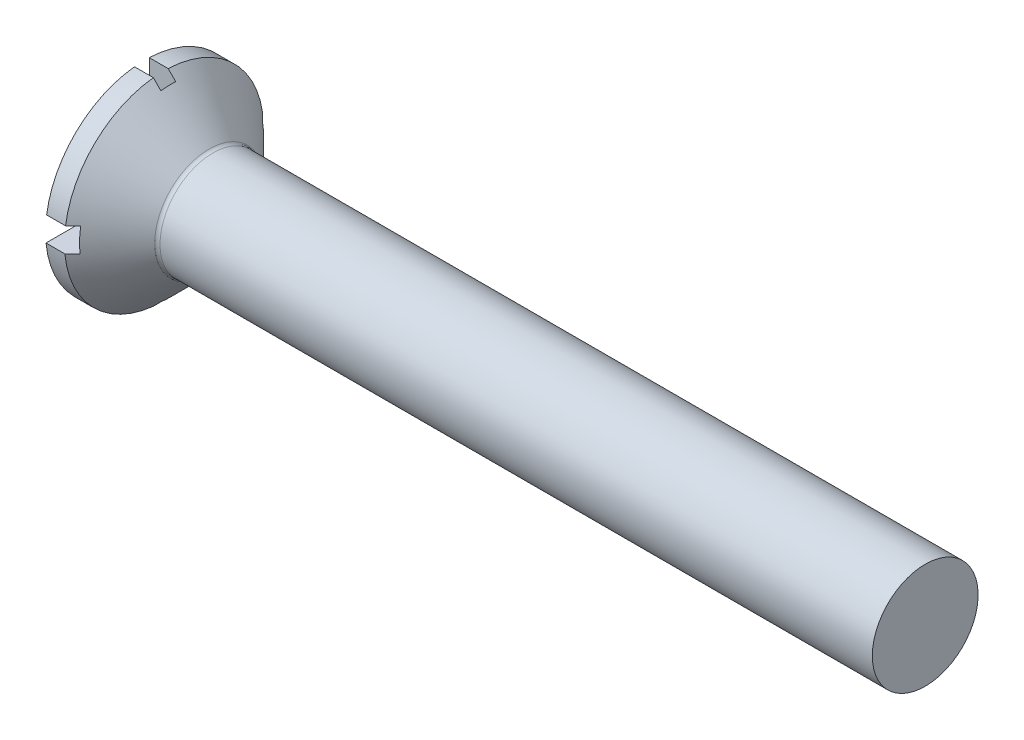
ISO-10303-21;
HEADER;
FILE_DESCRIPTION(('STEP AP214'),'2;1');
FILE_NAME('part.step','',(''),(''),'','','');
FILE_SCHEMA(('AUTOMOTIVE_DESIGN { 1 0 10303 214 1 1 1 1 }'));
ENDSEC;
DATA;
#1=APPLICATION_CONTEXT('core data for automotive mechanical design processes');
#2=APPLICATION_PROTOCOL_DEFINITION('international standard','automotive_design',2000,#1);
#3=PRODUCT_CONTEXT('',#1,'mechanical');
#4=PRODUCT('Part','Part','',(#3));
#5=PRODUCT_RELATED_PRODUCT_CATEGORY('part','',(#4));
#6=PRODUCT_DEFINITION_FORMATION('','',#4);
#7=PRODUCT_DEFINITION_CONTEXT('part definition',#1,'design');
#8=PRODUCT_DEFINITION('design','',#6,#7);
#9=PRODUCT_DEFINITION_SHAPE('','',#8);
#10=(LENGTH_UNIT() NAMED_UNIT(*) SI_UNIT(.MILLI.,.METRE.));
#11=(NAMED_UNIT(*) PLANE_ANGLE_UNIT() SI_UNIT($,.RADIAN.));
#12=(NAMED_UNIT(*) SI_UNIT($,.STERADIAN.) SOLID_ANGLE_UNIT());
#13=UNCERTAINTY_MEASURE_WITH_UNIT(LENGTH_MEASURE(1.E-05),#10,'distance_accuracy_value','');
#14=(GEOMETRIC_REPRESENTATION_CONTEXT(3) GLOBAL_UNCERTAINTY_ASSIGNED_CONTEXT((#13)) GLOBAL_UNIT_ASSIGNED_CONTEXT((#10,
#11,#12)) REPRESENTATION_CONTEXT('',''));
#15=CARTESIAN_POINT('',(0.,0.,0.));
#16=DIRECTION('',(0.,0.,1.));
#17=DIRECTION('',(1.,0.,0.));
#18=AXIS2_PLACEMENT_3D('',#15,#16,#17);
#19=CARTESIAN_POINT('',(1.,0.,0.));
#20=DIRECTION('',(-1.,0.,0.));
#21=DIRECTION('',(0.,0.,1.));
#22=AXIS2_PLACEMENT_3D('',#19,#20,#21);
#23=PLANE('',#22);
#24=DIRECTION('',(0.,1.,0.));
#25=VECTOR('',#24,1.);
#26=CARTESIAN_POINT('',(1.,-0.355709243839864,-0.156923110621762));
#27=LINE('',#26,#25);
#28=CARTESIAN_POINT('',(1.,-0.355709243839864,-0.156923110621762));
#29=VERTEX_POINT('',#28);
#30=CARTESIAN_POINT('',(1.0000000000166,-3.47646014463617,-0.156923110621762));
#31=VERTEX_POINT('',#30);
#32=EDGE_CURVE('E329',#29,#31,#27,.F.);
#33=ORIENTED_EDGE('',*,*,#32,.T.);
#34=CARTESIAN_POINT('',(1.0000000000332,0.,0.));
#35=DIRECTION('',(-1.,0.,0.));
#36=DIRECTION('',(0.,0.,1.));
#37=AXIS2_PLACEMENT_3D('',#34,#35,#36);
#38=CIRCLE('',#37,3.47999999996773);
#39=CARTESIAN_POINT('',(1.00000000002008,-3.456568160324,0.403158223159427));
#40=VERTEX_POINT('',#39);
#41=EDGE_CURVE('E229',#31,#40,#38,.T.);
#42=ORIENTED_EDGE('',*,*,#41,.T.);
#43=DIRECTION('',(0.,-1.,0.));
#44=VECTOR('',#43,1.);
#45=CARTESIAN_POINT('',(1.,-4.05674824255773,0.403158223159427));
#46=LINE('',#45,#44);
#47=CARTESIAN_POINT('',(1.,-0.355709243839864,0.403158223159425));
#48=VERTEX_POINT('',#47);
#49=EDGE_CURVE('E138',#40,#48,#46,.F.);
#50=ORIENTED_EDGE('',*,*,#49,.T.);
#51=DIRECTION('',(0.,0.,-1.));
#52=VECTOR('',#51,1.);
#53=CARTESIAN_POINT('',(1.,-0.355709243839864,0.403158223159425));
#54=LINE('',#53,#52);
#55=CARTESIAN_POINT('',(1.0000000000166,-0.355709243839867,3.46177280215467));
#56=VERTEX_POINT('',#55);
#57=EDGE_CURVE('E154',#48,#56,#54,.F.);
#58=ORIENTED_EDGE('',*,*,#57,.T.);
#59=CARTESIAN_POINT('',(1.0000000000332,0.,0.));
#60=DIRECTION('',(-1.,0.,0.));
#61=DIRECTION('',(0.,0.,1.));
#62=AXIS2_PLACEMENT_3D('',#59,#60,#61);
#63=CIRCLE('',#62,3.47999999996773);
#64=CARTESIAN_POINT('',(1.00000000002006,0.550618510763713,3.43616345005169));
#65=VERTEX_POINT('',#64);
#66=EDGE_CURVE('E19',#56,#65,#63,.T.);
#67=ORIENTED_EDGE('',*,*,#66,.T.);
#68=DIRECTION('',(0.,0.,1.));
#69=VECTOR('',#68,1.);
#70=CARTESIAN_POINT('',(1.,0.550618510763713,4.40763775047384));
#71=LINE('',#70,#69);
#72=CARTESIAN_POINT('',(1.,0.550618510763712,0.403158223159425));
#73=VERTEX_POINT('',#72);
#74=EDGE_CURVE('E118',#65,#73,#71,.F.);
#75=ORIENTED_EDGE('',*,*,#74,.T.);
#76=DIRECTION('',(0.,-1.,0.));
#77=VECTOR('',#76,1.);
#78=CARTESIAN_POINT('',(1.,0.550618510763713,0.403158223159425));
#79=LINE('',#78,#77);
#80=CARTESIAN_POINT('',(1.0000000000166,3.4565681603275,0.403158223159424));
#81=VERTEX_POINT('',#80);
#82=EDGE_CURVE('E338',#73,#81,#79,.F.);
#83=ORIENTED_EDGE('',*,*,#82,.T.);
#84=CARTESIAN_POINT('',(1.0000000000332,0.,0.));
#85=DIRECTION('',(-1.,0.,0.));
#86=DIRECTION('',(0.,0.,1.));
#87=AXIS2_PLACEMENT_3D('',#84,#85,#86);
#88=CIRCLE('',#87,3.47999999996773);
#89=CARTESIAN_POINT('',(1.0000000000201,3.47646014463266,-0.156923110621762));
#90=VERTEX_POINT('',#89);
#91=EDGE_CURVE('E153',#81,#90,#88,.T.);
#92=ORIENTED_EDGE('',*,*,#91,.T.);
#93=DIRECTION('',(0.,1.,0.));
#94=VECTOR('',#93,1.);
#95=CARTESIAN_POINT('',(1.,4.34325175744227,-0.156923110621762));
#96=LINE('',#95,#94);
#97=CARTESIAN_POINT('',(1.,0.550618510763712,-0.156923110621762));
#98=VERTEX_POINT('',#97);
#99=EDGE_CURVE('E340',#90,#98,#96,.F.);
#100=ORIENTED_EDGE('',*,*,#99,.T.);
#101=DIRECTION('',(0.,0.,1.));
#102=VECTOR('',#101,1.);
#103=CARTESIAN_POINT('',(1.,0.550618510763713,-0.156923110621761));
#104=LINE('',#103,#102);
#105=CARTESIAN_POINT('',(1.0000000000166,0.550618510763713,-3.4361634500552));
#106=VERTEX_POINT('',#105);
#107=EDGE_CURVE('E228',#98,#106,#104,.F.);
#108=ORIENTED_EDGE('',*,*,#107,.T.);
#109=CARTESIAN_POINT('',(1.0000000000332,0.,0.));
#110=DIRECTION('',(-1.,0.,0.));
#111=DIRECTION('',(0.,0.,1.));
#112=AXIS2_PLACEMENT_3D('',#109,#110,#111);
#113=CIRCLE('',#112,3.47999999996773);
#114=CARTESIAN_POINT('',(1.00000000002009,-0.355709243839861,-3.46177280215116));
#115=VERTEX_POINT('',#114);
#116=EDGE_CURVE('E401',#106,#115,#113,.T.);
#117=ORIENTED_EDGE('',*,*,#116,.T.);
#118=DIRECTION('',(0.,0.,-1.));
#119=VECTOR('',#118,1.);
#120=CARTESIAN_POINT('',(1.,-0.355709243839861,-4.09236224952616));
#121=LINE('',#120,#119);
#122=EDGE_CURVE('E147',#115,#29,#121,.F.);
#123=ORIENTED_EDGE('',*,*,#122,.T.);
#124=EDGE_LOOP('',(#33,#42,#50,#58,#67,#75,#83,#92,#100,#108,#117,#123));
#125=FACE_BOUND('',#124,.T.);
#126=ADVANCED_FACE('F16',(#125),#23,.T.);
#127=CARTESIAN_POINT('',(1.,0.550618510763713,-0.156923110621761));
#128=DIRECTION('',(0.,1.,0.));
#129=DIRECTION('',(0.,0.,1.));
#130=AXIS2_PLACEMENT_3D('',#127,#128,#129);
#131=PLANE('',#130);
#132=CARTESIAN_POINT('',(1.00000000000693,0.550618510763713,-3.43616345006499));
#133=CARTESIAN_POINT('',(0.952522390497496,0.550618510763713,-3.48424489385891));
#134=CARTESIAN_POINT('',(0.905033585692067,0.550618510763713,-3.53231527264755));
#135=CARTESIAN_POINT('',(0.810033585692013,0.550618510763713,-3.62843390000909));
#136=CARTESIAN_POINT('',(0.762522390497485,0.550618510763712,-3.67648214858208));
#137=CARTESIAN_POINT('',(0.715000000007059,0.550618510763712,-3.72451933214988));
#138=B_SPLINE_CURVE_WITH_KNOTS('',3,(#132,#133,#134,#135,#136,#137),.UNSPECIFIED.,.F.,.F.,(4,2,
4),(0.,0.202715394305867,0.405430787746274),.UNSPECIFIED.);
#139=CARTESIAN_POINT('',(0.715000000010424,0.550618510763712,-3.72451933215298));
#140=VERTEX_POINT('',#139);
#141=EDGE_CURVE('E222',#106,#140,#138,.T.);
#142=ORIENTED_EDGE('',*,*,#141,.F.);
#143=ORIENTED_EDGE('',*,*,#107,.F.);
#144=DIRECTION('',(-1.,0.,0.));
#145=VECTOR('',#144,1.);
#146=CARTESIAN_POINT('',(1.,0.550618510763712,-0.156923110621762));
#147=LINE('',#146,#145);
#148=CARTESIAN_POINT('',(0.,0.550618510763712,-0.156923110621762));
#149=VERTEX_POINT('',#148);
#150=EDGE_CURVE('E129',#98,#149,#147,.T.);
#151=ORIENTED_EDGE('',*,*,#150,.T.);
#152=DIRECTION('',(0.,0.,-1.));
#153=VECTOR('',#152,1.);
#154=CARTESIAN_POINT('',(0.,0.550618510763712,0.));
#155=LINE('',#154,#153);
#156=CARTESIAN_POINT('',(0.,0.550618510763712,-3.72451933215608));
#157=VERTEX_POINT('',#156);
#158=EDGE_CURVE('E308',#149,#157,#155,.T.);
#159=ORIENTED_EDGE('',*,*,#158,.T.);
#160=DIRECTION('',(1.,0.,0.));
#161=VECTOR('',#160,1.);
#162=CARTESIAN_POINT('',(1.,0.550618510763712,-3.72451933215607));
#163=LINE('',#162,#161);
#164=EDGE_CURVE('E227',#140,#157,#163,.F.);
#165=ORIENTED_EDGE('',*,*,#164,.F.);
#166=EDGE_LOOP('',(#142,#143,#151,#159,#165));
#167=FACE_BOUND('',#166,.T.);
#168=ADVANCED_FACE('F231',(#167),#131,.F.);
#169=CARTESIAN_POINT('',(1.,4.34325175744227,-0.156923110621762));
#170=DIRECTION('',(0.,0.,-1.));
#171=DIRECTION('',(-1.,0.,0.));
#172=AXIS2_PLACEMENT_3D('',#169,#170,#171);
#173=PLANE('',#172);
#174=DIRECTION('',(0.,1.,0.));
#175=VECTOR('',#174,1.);
#176=CARTESIAN_POINT('',(0.,0.,-0.156923110621762));
#177=LINE('',#176,#175);
#178=CARTESIAN_POINT('',(0.,3.7617283444386,-0.156923110621762));
#179=VERTEX_POINT('',#178);
#180=EDGE_CURVE('E304',#179,#149,#177,.F.);
#181=ORIENTED_EDGE('',*,*,#180,.T.);
#182=ORIENTED_EDGE('',*,*,#150,.F.);
#183=ORIENTED_EDGE('',*,*,#99,.F.);
#184=CARTESIAN_POINT('',(0.715000000003793,3.76172834443573,-0.156923110621762));
#185=CARTESIAN_POINT('',(0.762501760869479,3.71418540368166,-0.156923110621762));
#186=CARTESIAN_POINT('',(0.81000264130227,3.66664158332245,-0.156923110621762));
#187=CARTESIAN_POINT('',(0.905002641303341,3.57155218339247,-0.156923110621762));
#188=CARTESIAN_POINT('',(0.952501760871621,3.52400660382169,-0.156923110621762));
#189=CARTESIAN_POINT('',(1.00000000000701,3.47646014464577,-0.156923110621762));
#190=B_SPLINE_CURVE_WITH_KNOTS('',3,(#184,#185,#186,#187,#188,#189),.UNSPECIFIED.,.F.,.F.,(4,2,
4),(0.,0.201620277914085,0.403240555833609),.UNSPECIFIED.);
#191=CARTESIAN_POINT('',(0.715000000007359,3.76172834443217,-0.156923110621762));
#192=VERTEX_POINT('',#191);
#193=EDGE_CURVE('E215',#192,#90,#190,.T.);
#194=ORIENTED_EDGE('',*,*,#193,.F.);
#195=DIRECTION('',(-1.,0.,0.));
#196=VECTOR('',#195,1.);
#197=CARTESIAN_POINT('',(1.,3.7617283444386,-0.156923110621762));
#198=LINE('',#197,#196);
#199=EDGE_CURVE('E336',#179,#192,#198,.F.);
#200=ORIENTED_EDGE('',*,*,#199,.F.);
#201=EDGE_LOOP('',(#181,#182,#183,#194,#200));
#202=FACE_BOUND('',#201,.T.);
#203=ADVANCED_FACE('F234',(#202),#173,.F.);
#204=CARTESIAN_POINT('',(1.,0.550618510763713,0.403158223159425));
#205=DIRECTION('',(0.,0.,1.));
#206=DIRECTION('',(0.,-1.,0.));
#207=AXIS2_PLACEMENT_3D('',#204,#205,#206);
#208=PLANE('',#207);
#209=CARTESIAN_POINT('',(1.00000000000697,3.4565681603372,0.403158223159424));
#210=CARTESIAN_POINT('',(0.952511808864706,3.50437729702399,0.403158223159424));
#211=CARTESIAN_POINT('',(0.905017713279324,3.55218056600584,0.403158223159424));
#212=CARTESIAN_POINT('',(0.810017713279351,3.64777536850222,0.403158223159424));
#213=CARTESIAN_POINT('',(0.762511808864773,3.69556690201678,0.403158223159424));
#214=CARTESIAN_POINT('',(0.715000000007091,3.7433525678264,0.403158223159424));
#215=B_SPLINE_CURVE_WITH_KNOTS('',3,(#209,#210,#211,#212,#213,#214),.UNSPECIFIED.,.F.,.F.,(4,2,
4),(0.,0.202157302038321,0.404314603833935),.UNSPECIFIED.);
#216=CARTESIAN_POINT('',(0.715000000010439,3.7433525678295,0.403158223159424));
#217=VERTEX_POINT('',#216);
#218=EDGE_CURVE('E208',#81,#217,#215,.T.);
#219=ORIENTED_EDGE('',*,*,#218,.F.);
#220=ORIENTED_EDGE('',*,*,#82,.F.);
#221=DIRECTION('',(1.,0.,0.));
#222=VECTOR('',#221,1.);
#223=CARTESIAN_POINT('',(1.,0.550618510763712,0.403158223159425));
#224=LINE('',#223,#222);
#225=CARTESIAN_POINT('',(0.,0.550618510763713,0.403158223159425));
#226=VERTEX_POINT('',#225);
#227=EDGE_CURVE('E330',#73,#226,#224,.F.);
#228=ORIENTED_EDGE('',*,*,#227,.T.);
#229=DIRECTION('',(0.,1.,0.));
#230=VECTOR('',#229,1.);
#231=CARTESIAN_POINT('',(0.,0.,0.403158223159425));
#232=LINE('',#231,#230);
#233=CARTESIAN_POINT('',(0.,3.7433525678326,0.403158223159424));
#234=VERTEX_POINT('',#233);
#235=EDGE_CURVE('E299',#226,#234,#232,.T.);
#236=ORIENTED_EDGE('',*,*,#235,.T.);
#237=DIRECTION('',(1.,0.,0.));
#238=VECTOR('',#237,1.);
#239=CARTESIAN_POINT('',(1.,3.7433525678326,0.403158223159424));
#240=LINE('',#239,#238);
#241=EDGE_CURVE('E334',#217,#234,#240,.F.);
#242=ORIENTED_EDGE('',*,*,#241,.F.);
#243=EDGE_LOOP('',(#219,#220,#228,#236,#242));
#244=FACE_BOUND('',#243,.T.);
#245=ADVANCED_FACE('F237',(#244),#208,.F.);
#246=CARTESIAN_POINT('',(1.,0.550618510763713,4.40763775047384));
#247=DIRECTION('',(0.,1.,0.));
#248=DIRECTION('',(0.,0.,1.));
#249=AXIS2_PLACEMENT_3D('',#246,#247,#248);
#250=PLANE('',#249);
#251=DIRECTION('',(0.,0.,-1.));
#252=VECTOR('',#251,1.);
#253=CARTESIAN_POINT('',(0.,0.550618510763713,0.));
#254=LINE('',#253,#252);
#255=CARTESIAN_POINT('',(0.,0.550618510763713,3.72451933215608));
#256=VERTEX_POINT('',#255);
#257=EDGE_CURVE('E294',#256,#226,#254,.T.);
#258=ORIENTED_EDGE('',*,*,#257,.T.);
#259=ORIENTED_EDGE('',*,*,#227,.F.);
#260=ORIENTED_EDGE('',*,*,#74,.F.);
#261=CARTESIAN_POINT('',(0.715000000003765,0.550618510763713,3.72451933215321));
#262=CARTESIAN_POINT('',(0.76252239049474,0.550618510763713,3.67648214858485));
#263=CARTESIAN_POINT('',(0.810033585689818,0.550618510763713,3.62843390001131));
#264=CARTESIAN_POINT('',(0.90503358569097,0.550618510763713,3.53231527264866));
#265=CARTESIAN_POINT('',(0.952522390496948,0.550618510763713,3.48424489385947));
#266=CARTESIAN_POINT('',(1.00000000000693,0.550618510763713,3.43616345006499));
#267=B_SPLINE_CURVE_WITH_KNOTS('',3,(#261,#262,#263,#264,#265,#266),.UNSPECIFIED.,.F.,.F.,(4,2,
4),(0.,0.202715393442749,0.405430787750959),.UNSPECIFIED.);
#268=CARTESIAN_POINT('',(0.715000000007359,0.550618510763713,3.72451933214958));
#269=VERTEX_POINT('',#268);
#270=EDGE_CURVE('E111',#269,#65,#267,.T.);
#271=ORIENTED_EDGE('',*,*,#270,.F.);
#272=DIRECTION('',(1.,0.,0.));
#273=VECTOR('',#272,1.);
#274=CARTESIAN_POINT('',(1.,0.550618510763713,3.72451933215607));
#275=LINE('',#274,#273);
#276=EDGE_CURVE('E327',#256,#269,#275,.T.);
#277=ORIENTED_EDGE('',*,*,#276,.F.);
#278=EDGE_LOOP('',(#258,#259,#260,#271,#277));
#279=FACE_BOUND('',#278,.T.);
#280=ADVANCED_FACE('F241',(#279),#250,.F.);
#281=CARTESIAN_POINT('',(1.,-0.355709243839864,-0.156923110621762));
#282=DIRECTION('',(0.,0.,-1.));
#283=DIRECTION('',(-1.,0.,0.));
#284=AXIS2_PLACEMENT_3D('',#281,#282,#283);
#285=PLANE('',#284);
#286=CARTESIAN_POINT('',(1.00000000000701,-3.47646014464577,-0.156923110621762));
#287=CARTESIAN_POINT('',(0.952501760872176,-3.52400660382113,-0.156923110621762));
#288=CARTESIAN_POINT('',(0.90500264130445,-3.57155218339136,-0.156923110621762));
#289=CARTESIAN_POINT('',(0.810002641304488,-3.66664158332023,-0.156923110621762));
#290=CARTESIAN_POINT('',(0.762501760872253,-3.71418540367889,-0.156923110621762));
#291=CARTESIAN_POINT('',(0.715000000007121,-3.7617283444324,-0.156923110621762));
#292=B_SPLINE_CURVE_WITH_KNOTS('',3,(#286,#287,#288,#289,#290,#291),.UNSPECIFIED.,.F.,.F.,(4,2,
4),(0.,0.20162027791717,0.4032405558289),.UNSPECIFIED.);
#293=CARTESIAN_POINT('',(0.715000000010455,-3.7617283444355,-0.156923110621762));
#294=VERTEX_POINT('',#293);
#295=EDGE_CURVE('E194',#31,#294,#292,.T.);
#296=ORIENTED_EDGE('',*,*,#295,.F.);
#297=ORIENTED_EDGE('',*,*,#32,.F.);
#298=DIRECTION('',(1.,0.,0.));
#299=VECTOR('',#298,1.);
#300=CARTESIAN_POINT('',(1.,-0.355709243839864,-0.156923110621762));
#301=LINE('',#300,#299);
#302=CARTESIAN_POINT('',(0.,-0.355709243839862,-0.156923110621762));
#303=VERTEX_POINT('',#302);
#304=EDGE_CURVE('E321',#29,#303,#301,.F.);
#305=ORIENTED_EDGE('',*,*,#304,.T.);
#306=DIRECTION('',(0.,1.,0.));
#307=VECTOR('',#306,1.);
#308=CARTESIAN_POINT('',(0.,0.,-0.156923110621762));
#309=LINE('',#308,#307);
#310=CARTESIAN_POINT('',(0.,-3.7617283444386,-0.156923110621762));
#311=VERTEX_POINT('',#310);
#312=EDGE_CURVE('E289',#303,#311,#309,.F.);
#313=ORIENTED_EDGE('',*,*,#312,.T.);
#314=DIRECTION('',(-1.,0.,0.));
#315=VECTOR('',#314,1.);
#316=CARTESIAN_POINT('',(1.,-3.7617283444386,-0.156923110621762));
#317=LINE('',#316,#315);
#318=EDGE_CURVE('E325',#294,#311,#317,.T.);
#319=ORIENTED_EDGE('',*,*,#318,.F.);
#320=EDGE_LOOP('',(#296,#297,#305,#313,#319));
#321=FACE_BOUND('',#320,.T.);
#322=ADVANCED_FACE('F245',(#321),#285,.F.);
#323=CARTESIAN_POINT('',(1.,-0.355709243839861,-4.09236224952616));
#324=DIRECTION('',(0.,-1.,0.));
#325=DIRECTION('',(0.,0.,-1.));
#326=AXIS2_PLACEMENT_3D('',#323,#324,#325);
#327=PLANE('',#326);
#328=DIRECTION('',(0.,0.,-1.));
#329=VECTOR('',#328,1.);
#330=CARTESIAN_POINT('',(0.,-0.355709243839861,0.));
#331=LINE('',#330,#329);
#332=CARTESIAN_POINT('',(0.,-0.355709243839861,-3.74815900594504));
#333=VERTEX_POINT('',#332);
#334=EDGE_CURVE('E285',#333,#303,#331,.F.);
#335=ORIENTED_EDGE('',*,*,#334,.T.);
#336=ORIENTED_EDGE('',*,*,#304,.F.);
#337=ORIENTED_EDGE('',*,*,#122,.F.);
#338=CARTESIAN_POINT('',(0.715000000003782,-0.355709243839861,-3.74815900594217));
#339=CARTESIAN_POINT('',(0.762509154586003,-0.355709243839861,-3.70043708228406));
#340=CARTESIAN_POINT('',(0.810013731868789,-0.355709243839861,-3.65271060348215));
#341=CARTESIAN_POINT('',(0.905013731869861,-0.355709243839861,-3.55724853555621));
#342=CARTESIAN_POINT('',(0.95250915458814,-0.355709243839861,-3.50951294643218));
#343=CARTESIAN_POINT('',(1.00000000000698,-0.355709243839861,-3.46177280216434));
#344=B_SPLINE_CURVE_WITH_KNOTS('',3,(#338,#339,#340,#341,#342,#343),.UNSPECIFIED.,.F.,.F.,(4,2,
4),(0.,0.202016125036606,0.404032250219377),.UNSPECIFIED.);
#345=CARTESIAN_POINT('',(0.715000000007358,-0.355709243839861,-3.74815900593858));
#346=VERTEX_POINT('',#345);
#347=EDGE_CURVE('E176',#346,#115,#344,.T.);
#348=ORIENTED_EDGE('',*,*,#347,.F.);
#349=DIRECTION('',(1.,0.,0.));
#350=VECTOR('',#349,1.);
#351=CARTESIAN_POINT('',(1.,-0.355709243839861,-3.74815900594503));
#352=LINE('',#351,#350);
#353=EDGE_CURVE('E158',#333,#346,#352,.T.);
#354=ORIENTED_EDGE('',*,*,#353,.F.);
#355=EDGE_LOOP('',(#335,#336,#337,#348,#354));
#356=FACE_BOUND('',#355,.T.);
#357=ADVANCED_FACE('F249',(#356),#327,.F.);
#358=CARTESIAN_POINT('',(1.,-0.355709243839864,0.403158223159425));
#359=DIRECTION('',(0.,-1.,0.));
#360=DIRECTION('',(0.,0.,-1.));
#361=AXIS2_PLACEMENT_3D('',#358,#359,#360);
#362=PLANE('',#361);
#363=CARTESIAN_POINT('',(1.00000000000698,-0.355709243839867,3.46177280216434));
#364=CARTESIAN_POINT('',(0.952509154588694,-0.355709243839867,3.50951294643162));
#365=CARTESIAN_POINT('',(0.905013731870968,-0.355709243839867,3.5572485355551));
#366=CARTESIAN_POINT('',(0.810013731871,-0.355709243839867,3.65271060347993));
#367=CARTESIAN_POINT('',(0.762509154588766,-0.355709243839867,3.70043708228128));
#368=CARTESIAN_POINT('',(0.715000000007098,-0.355709243839868,3.74815900593884));
#369=B_SPLINE_CURVE_WITH_KNOTS('',3,(#363,#364,#365,#366,#367,#368),.UNSPECIFIED.,.F.,.F.,(4,2,
4),(0.,0.202016125180422,0.404032250214679),.UNSPECIFIED.);
#370=CARTESIAN_POINT('',(0.715000000010443,-0.355709243839868,3.74815900594194));
#371=VERTEX_POINT('',#370);
#372=EDGE_CURVE('E152',#56,#371,#369,.T.);
#373=ORIENTED_EDGE('',*,*,#372,.F.);
#374=ORIENTED_EDGE('',*,*,#57,.F.);
#375=DIRECTION('',(1.,0.,0.));
#376=VECTOR('',#375,1.);
#377=CARTESIAN_POINT('',(1.,-0.355709243839864,0.403158223159425));
#378=LINE('',#377,#376);
#379=CARTESIAN_POINT('',(0.,-0.355709243839864,0.403158223159426));
#380=VERTEX_POINT('',#379);
#381=EDGE_CURVE('E316',#48,#380,#378,.F.);
#382=ORIENTED_EDGE('',*,*,#381,.T.);
#383=DIRECTION('',(0.,0.,-1.));
#384=VECTOR('',#383,1.);
#385=CARTESIAN_POINT('',(0.,-0.355709243839864,0.));
#386=LINE('',#385,#384);
#387=CARTESIAN_POINT('',(0.,-0.355709243839866,3.74815900594503));
#388=VERTEX_POINT('',#387);
#389=EDGE_CURVE('E281',#380,#388,#386,.F.);
#390=ORIENTED_EDGE('',*,*,#389,.T.);
#391=DIRECTION('',(1.,0.,0.));
#392=VECTOR('',#391,1.);
#393=CARTESIAN_POINT('',(1.,-0.355709243839868,3.74815900594503));
#394=LINE('',#393,#392);
#395=EDGE_CURVE('E34',#371,#388,#394,.F.);
#396=ORIENTED_EDGE('',*,*,#395,.F.);
#397=EDGE_LOOP('',(#373,#374,#382,#390,#396));
#398=FACE_BOUND('',#397,.T.);
#399=ADVANCED_FACE('F160',(#398),#362,.F.);
#400=CARTESIAN_POINT('',(1.,-4.05674824255773,0.403158223159427));
#401=DIRECTION('',(0.,0.,1.));
#402=DIRECTION('',(0.,-1.,0.));
#403=AXIS2_PLACEMENT_3D('',#400,#401,#402);
#404=PLANE('',#403);
#405=DIRECTION('',(0.,1.,0.));
#406=VECTOR('',#405,1.);
#407=CARTESIAN_POINT('',(0.,0.,0.403158223159427));
#408=LINE('',#407,#406);
#409=CARTESIAN_POINT('',(0.,-3.7433525678326,0.403158223159427));
#410=VERTEX_POINT('',#409);
#411=EDGE_CURVE('E277',#410,#380,#408,.T.);
#412=ORIENTED_EDGE('',*,*,#411,.T.);
#413=ORIENTED_EDGE('',*,*,#381,.F.);
#414=ORIENTED_EDGE('',*,*,#49,.F.);
#415=CARTESIAN_POINT('',(0.715000000003779,-3.74335256782973,0.403158223159427));
#416=CARTESIAN_POINT('',(0.762511808862014,-3.69556690201956,0.403158223159427));
#417=CARTESIAN_POINT('',(0.810017713277144,-3.64777536850444,0.403158223159427));
#418=CARTESIAN_POINT('',(0.905017713278221,-3.55218056600695,0.403158223159427));
#419=CARTESIAN_POINT('',(0.952511808864155,-3.50437729702455,0.403158223159427));
#420=CARTESIAN_POINT('',(1.00000000000697,-3.4565681603372,0.403158223159427));
#421=B_SPLINE_CURVE_WITH_KNOTS('',3,(#415,#416,#417,#418,#419,#420),.UNSPECIFIED.,.F.,.F.,(4,2,
4),(0.,0.202157301797964,0.404314603838633),.UNSPECIFIED.);
#422=CARTESIAN_POINT('',(0.715000000007358,-3.74335256782613,0.403158223159427));
#423=VERTEX_POINT('',#422);
#424=EDGE_CURVE('E162',#423,#40,#421,.T.);
#425=ORIENTED_EDGE('',*,*,#424,.F.);
#426=DIRECTION('',(1.,0.,0.));
#427=VECTOR('',#426,1.);
#428=CARTESIAN_POINT('',(1.,-3.7433525678326,0.403158223159427));
#429=LINE('',#428,#427);
#430=EDGE_CURVE('E312',#410,#423,#429,.T.);
#431=ORIENTED_EDGE('',*,*,#430,.F.);
#432=EDGE_LOOP('',(#412,#413,#414,#425,#431));
#433=FACE_BOUND('',#432,.T.);
#434=ADVANCED_FACE('F258',(#433),#404,.F.);
#435=CARTESIAN_POINT('',(0.,0.,0.));
#436=DIRECTION('',(1.,0.,0.));
#437=DIRECTION('',(0.,0.,-1.));
#438=AXIS2_PLACEMENT_3D('',#435,#436,#437);
#439=PLANE('',#438);
#440=CARTESIAN_POINT('',(0.,0.,0.));
#441=DIRECTION('',(1.,0.,0.));
#442=DIRECTION('',(0.,0.,-1.));
#443=AXIS2_PLACEMENT_3D('',#440,#441,#442);
#444=CIRCLE('',#443,3.765);
#445=EDGE_CURVE('E280',#157,#179,#444,.T.);
#446=ORIENTED_EDGE('',*,*,#445,.F.);
#447=ORIENTED_EDGE('',*,*,#158,.F.);
#448=ORIENTED_EDGE('',*,*,#180,.F.);
#449=EDGE_LOOP('',(#446,#447,#448));
#450=FACE_BOUND('',#449,.T.);
#451=ADVANCED_FACE('F396',(#450),#439,.F.);
#452=CARTESIAN_POINT('',(0.,0.,0.));
#453=DIRECTION('',(1.,0.,0.));
#454=DIRECTION('',(0.,0.,-1.));
#455=AXIS2_PLACEMENT_3D('',#452,#453,#454);
#456=PLANE('',#455);
#457=CARTESIAN_POINT('',(0.,0.,0.));
#458=DIRECTION('',(1.,0.,0.));
#459=DIRECTION('',(0.,0.,-1.));
#460=AXIS2_PLACEMENT_3D('',#457,#458,#459);
#461=CIRCLE('',#460,3.765);
#462=EDGE_CURVE('E385',#234,#256,#461,.T.);
#463=ORIENTED_EDGE('',*,*,#462,.F.);
#464=ORIENTED_EDGE('',*,*,#235,.F.);
#465=ORIENTED_EDGE('',*,*,#257,.F.);
#466=EDGE_LOOP('',(#463,#464,#465));
#467=FACE_BOUND('',#466,.T.);
#468=ADVANCED_FACE('F430',(#467),#456,.F.);
#469=CARTESIAN_POINT('',(0.,0.,0.));
#470=DIRECTION('',(1.,0.,0.));
#471=DIRECTION('',(0.,0.,-1.));
#472=AXIS2_PLACEMENT_3D('',#469,#470,#471);
#473=PLANE('',#472);
#474=CARTESIAN_POINT('',(0.,0.,0.));
#475=DIRECTION('',(1.,0.,0.));
#476=DIRECTION('',(0.,0.,-1.));
#477=AXIS2_PLACEMENT_3D('',#474,#475,#476);
#478=CIRCLE('',#477,3.765);
#479=EDGE_CURVE('E382',#311,#333,#478,.T.);
#480=ORIENTED_EDGE('',*,*,#479,.F.);
#481=ORIENTED_EDGE('',*,*,#312,.F.);
#482=ORIENTED_EDGE('',*,*,#334,.F.);
#483=EDGE_LOOP('',(#480,#481,#482));
#484=FACE_BOUND('',#483,.T.);
#485=ADVANCED_FACE('F427',(#484),#473,.F.);
#486=CARTESIAN_POINT('',(0.,0.,0.));
#487=DIRECTION('',(1.,0.,0.));
#488=DIRECTION('',(0.,0.,-1.));
#489=AXIS2_PLACEMENT_3D('',#486,#487,#488);
#490=PLANE('',#489);
#491=CARTESIAN_POINT('',(0.,0.,0.));
#492=DIRECTION('',(1.,0.,0.));
#493=DIRECTION('',(0.,0.,-1.));
#494=AXIS2_PLACEMENT_3D('',#491,#492,#493);
#495=CIRCLE('',#494,3.765);
#496=EDGE_CURVE('E370',#388,#410,#495,.T.);
#497=ORIENTED_EDGE('',*,*,#496,.F.);
#498=ORIENTED_EDGE('',*,*,#389,.F.);
#499=ORIENTED_EDGE('',*,*,#411,.F.);
#500=EDGE_LOOP('',(#497,#498,#499));
#501=FACE_BOUND('',#500,.T.);
#502=ADVANCED_FACE('F409',(#501),#490,.F.);
#503=CARTESIAN_POINT('',(11.8531386861314,0.,0.));
#504=DIRECTION('',(1.,0.,0.));
#505=DIRECTION('',(0.,0.,-1.));
#506=AXIS2_PLACEMENT_3D('',#503,#504,#505);
#507=CYLINDRICAL_SURFACE('',#506,3.765);
#508=ORIENTED_EDGE('',*,*,#164,.T.);
#509=ORIENTED_EDGE('',*,*,#445,.T.);
#510=ORIENTED_EDGE('',*,*,#199,.T.);
#511=CARTESIAN_POINT('',(0.715000000013788,0.,0.));
#512=DIRECTION('',(-1.,0.,0.));
#513=DIRECTION('',(0.,0.,-1.));
#514=AXIS2_PLACEMENT_3D('',#511,#512,#513);
#515=CIRCLE('',#514,3.76499999998714);
#516=EDGE_CURVE('E361',#140,#192,#515,.F.);
#517=ORIENTED_EDGE('',*,*,#516,.F.);
#518=EDGE_LOOP('',(#508,#509,#510,#517));
#519=FACE_BOUND('',#518,.T.);
#520=ADVANCED_FACE('F390',(#519),#507,.T.);
#521=CARTESIAN_POINT('',(11.8531386861314,0.,0.));
#522=DIRECTION('',(1.,0.,0.));
#523=DIRECTION('',(0.,0.,-1.));
#524=AXIS2_PLACEMENT_3D('',#521,#522,#523);
#525=CYLINDRICAL_SURFACE('',#524,3.765);
#526=ORIENTED_EDGE('',*,*,#241,.T.);
#527=ORIENTED_EDGE('',*,*,#462,.T.);
#528=ORIENTED_EDGE('',*,*,#276,.T.);
#529=CARTESIAN_POINT('',(0.715000000013788,0.,0.));
#530=DIRECTION('',(-1.,0.,0.));
#531=DIRECTION('',(0.,0.,-1.));
#532=AXIS2_PLACEMENT_3D('',#529,#530,#531);
#533=CIRCLE('',#532,3.76499999998714);
#534=EDGE_CURVE('E353',#217,#269,#533,.F.);
#535=ORIENTED_EDGE('',*,*,#534,.F.);
#536=EDGE_LOOP('',(#526,#527,#528,#535));
#537=FACE_BOUND('',#536,.T.);
#538=ADVANCED_FACE('F415',(#537),#525,.T.);
#539=CARTESIAN_POINT('',(11.8531386861314,0.,0.));
#540=DIRECTION('',(1.,0.,0.));
#541=DIRECTION('',(0.,0.,-1.));
#542=AXIS2_PLACEMENT_3D('',#539,#540,#541);
#543=CYLINDRICAL_SURFACE('',#542,3.765);
#544=ORIENTED_EDGE('',*,*,#318,.T.);
#545=ORIENTED_EDGE('',*,*,#479,.T.);
#546=ORIENTED_EDGE('',*,*,#353,.T.);
#547=CARTESIAN_POINT('',(0.715000000013788,0.,0.));
#548=DIRECTION('',(-1.,0.,0.));
#549=DIRECTION('',(0.,0.,-1.));
#550=AXIS2_PLACEMENT_3D('',#547,#548,#549);
#551=CIRCLE('',#550,3.76499999998714);
#552=EDGE_CURVE('E344',#294,#346,#551,.F.);
#553=ORIENTED_EDGE('',*,*,#552,.F.);
#554=EDGE_LOOP('',(#544,#545,#546,#553));
#555=FACE_BOUND('',#554,.T.);
#556=ADVANCED_FACE('F411',(#555),#543,.T.);
#557=CARTESIAN_POINT('',(11.8531386861314,0.,0.));
#558=DIRECTION('',(1.,0.,0.));
#559=DIRECTION('',(0.,0.,-1.));
#560=AXIS2_PLACEMENT_3D('',#557,#558,#559);
#561=CYLINDRICAL_SURFACE('',#560,3.765);
#562=ORIENTED_EDGE('',*,*,#395,.T.);
#563=ORIENTED_EDGE('',*,*,#496,.T.);
#564=ORIENTED_EDGE('',*,*,#430,.T.);
#565=CARTESIAN_POINT('',(0.715000000013788,0.,0.));
#566=DIRECTION('',(-1.,0.,0.));
#567=DIRECTION('',(0.,0.,-1.));
#568=AXIS2_PLACEMENT_3D('',#565,#566,#567);
#569=CIRCLE('',#568,3.76499999998714);
#570=EDGE_CURVE('E276',#371,#423,#569,.F.);
#571=ORIENTED_EDGE('',*,*,#570,.F.);
#572=EDGE_LOOP('',(#562,#563,#564,#571));
#573=FACE_BOUND('',#572,.T.);
#574=ADVANCED_FACE('F188',(#573),#561,.T.);
#575=CARTESIAN_POINT('',(0.715000000070631,0.,0.));
#576=DIRECTION('',(-1.,0.,0.));
#577=DIRECTION('',(0.,0.,1.));
#578=AXIS2_PLACEMENT_3D('',#575,#576,#577);
#579=CONICAL_SURFACE('',#578,3.7649999999303,0.785398163397448);
#580=CARTESIAN_POINT('',(2.42142135623731,0.,0.));
#581=DIRECTION('',(-1.,0.,0.));
#582=DIRECTION('',(0.,0.,-1.));
#583=AXIS2_PLACEMENT_3D('',#580,#581,#582);
#584=CIRCLE('',#583,2.05857864376269);
#585=CARTESIAN_POINT('',(2.42142135623731,0.,-2.05857864376269));
#586=VERTEX_POINT('',#585);
#587=EDGE_CURVE('E273',#586,#586,#584,.T.);
#588=ORIENTED_EDGE('',*,*,#587,.T.);
#589=EDGE_LOOP('',(#588));
#590=FACE_BOUND('',#589,.T.);
#591=ORIENTED_EDGE('',*,*,#372,.T.);
#592=ORIENTED_EDGE('',*,*,#570,.T.);
#593=ORIENTED_EDGE('',*,*,#424,.T.);
#594=ORIENTED_EDGE('',*,*,#41,.F.);
#595=ORIENTED_EDGE('',*,*,#295,.T.);
#596=ORIENTED_EDGE('',*,*,#552,.T.);
#597=ORIENTED_EDGE('',*,*,#347,.T.);
#598=ORIENTED_EDGE('',*,*,#116,.F.);
#599=ORIENTED_EDGE('',*,*,#141,.T.);
#600=ORIENTED_EDGE('',*,*,#516,.T.);
#601=ORIENTED_EDGE('',*,*,#193,.T.);
#602=ORIENTED_EDGE('',*,*,#91,.F.);
#603=ORIENTED_EDGE('',*,*,#218,.T.);
#604=ORIENTED_EDGE('',*,*,#534,.T.);
#605=ORIENTED_EDGE('',*,*,#270,.T.);
#606=ORIENTED_EDGE('',*,*,#66,.F.);
#607=EDGE_LOOP('',(#591,#592,#593,#594,#595,#596,#597,#598,#599,#600,#601,#602,#603,#604,#605,#606));
#608=FACE_BOUND('',#607,.T.);
#609=ADVANCED_FACE('F149',(#590,#608),#579,.T.);
#610=CARTESIAN_POINT('',(29.5,0.,0.));
#611=DIRECTION('',(-1.,0.,0.));
#612=DIRECTION('',(0.,0.,1.));
#613=AXIS2_PLACEMENT_3D('',#610,#611,#612);
#614=PLANE('',#613);
#615=CARTESIAN_POINT('',(29.5,0.,0.));
#616=DIRECTION('',(-1.,0.,0.));
#617=DIRECTION('',(0.,0.,1.));
#618=AXIS2_PLACEMENT_3D('',#615,#616,#617);
#619=CIRCLE('',#618,2.);
#620=CARTESIAN_POINT('',(29.5,0.,2.));
#621=VERTEX_POINT('',#620);
#622=EDGE_CURVE('E25',#621,#621,#619,.T.);
#623=ORIENTED_EDGE('',*,*,#622,.F.);
#624=EDGE_LOOP('',(#623));
#625=FACE_BOUND('',#624,.T.);
#626=ADVANCED_FACE('F187',(#625),#614,.F.);
#627=CARTESIAN_POINT('',(2.56284271247462,0.,0.));
#628=DIRECTION('',(-1.,0.,0.));
#629=DIRECTION('',(0.,0.,-1.));
#630=AXIS2_PLACEMENT_3D('',#627,#628,#629);
#631=TOROIDAL_SURFACE('',#630,2.2,0.2);
#632=CARTESIAN_POINT('',(2.56284271247462,0.,0.));
#633=DIRECTION('',(-1.,0.,0.));
#634=DIRECTION('',(0.,0.,1.));
#635=AXIS2_PLACEMENT_3D('',#632,#633,#634);
#636=CIRCLE('',#635,2.);
#637=CARTESIAN_POINT('',(2.56284271247462,0.,2.));
#638=VERTEX_POINT('',#637);
#639=EDGE_CURVE('E11',#638,#638,#636,.F.);
#640=ORIENTED_EDGE('',*,*,#639,.F.);
#641=EDGE_LOOP('',(#640));
#642=FACE_BOUND('',#641,.T.);
#643=ORIENTED_EDGE('',*,*,#587,.F.);
#644=EDGE_LOOP('',(#643));
#645=FACE_BOUND('',#644,.T.);
#646=ADVANCED_FACE('F262',(#642,#645),#631,.F.);
#647=CARTESIAN_POINT('',(-0.587069180985524,0.,0.));
#648=DIRECTION('',(-1.,0.,0.));
#649=DIRECTION('',(0.,0.,1.));
#650=AXIS2_PLACEMENT_3D('',#647,#648,#649);
#651=CYLINDRICAL_SURFACE('',#650,2.);
#652=ORIENTED_EDGE('',*,*,#639,.T.);
#653=EDGE_LOOP('',(#652));
#654=FACE_BOUND('',#653,.T.);
#655=ORIENTED_EDGE('',*,*,#622,.T.);
#656=EDGE_LOOP('',(#655));
#657=FACE_BOUND('',#656,.T.);
#658=ADVANCED_FACE('F260',(#654,#657),#651,.T.);
#659=CLOSED_SHELL('',(#126,#168,#203,#245,#280,#322,#357,#399,#434,#451,#468,#485,#502,#520,
#538,#556,#574,#609,#626,#646,#658));
#660=MANIFOLD_SOLID_BREP('B1',#659);
#661=ADVANCED_BREP_SHAPE_REPRESENTATION('',(#18,#660),#14);
#662=SHAPE_DEFINITION_REPRESENTATION(#9,#661);
ENDSEC;
END-ISO-10303-21;
